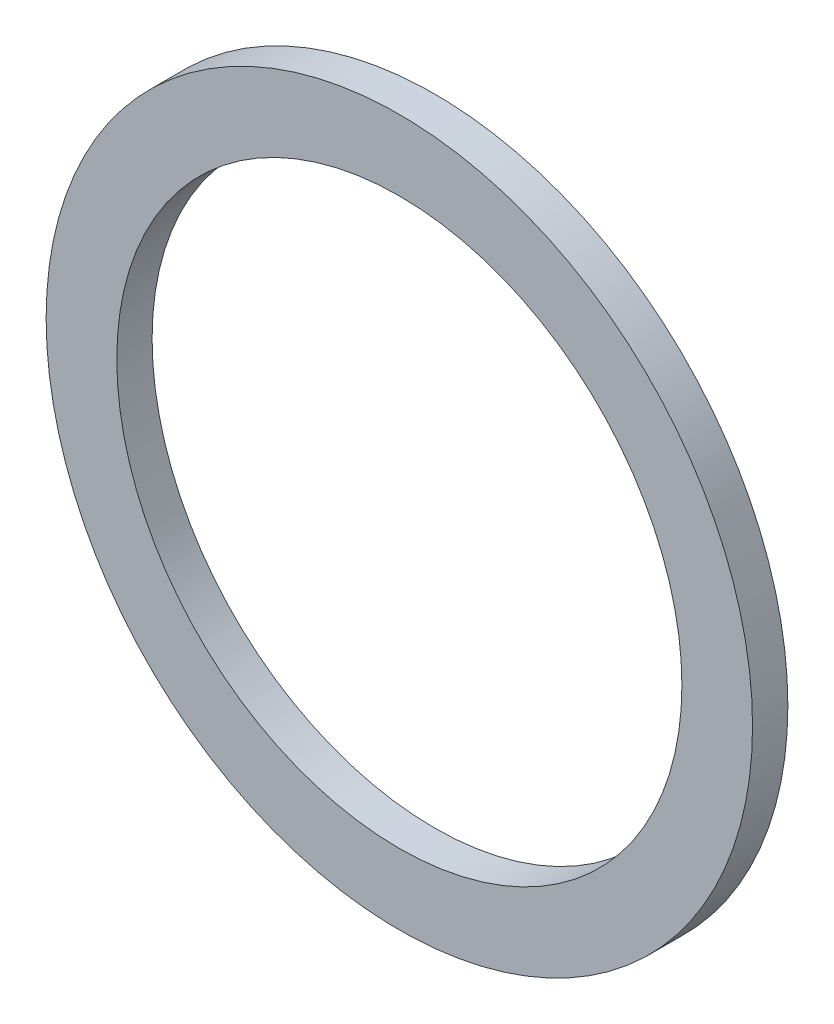
ISO-10303-21;
HEADER;
FILE_DESCRIPTION(('STEP AP214'),'2;1');
FILE_NAME('part.step','',(''),(''),'','','');
FILE_SCHEMA(('AUTOMOTIVE_DESIGN { 1 0 10303 214 1 1 1 1 }'));
ENDSEC;
DATA;
#1=APPLICATION_CONTEXT('core data for automotive mechanical design processes');
#2=APPLICATION_PROTOCOL_DEFINITION('international standard','automotive_design',2000,#1);
#3=PRODUCT_CONTEXT('',#1,'mechanical');
#4=PRODUCT('Part','Part','',(#3));
#5=PRODUCT_RELATED_PRODUCT_CATEGORY('part','',(#4));
#6=PRODUCT_DEFINITION_FORMATION('','',#4);
#7=PRODUCT_DEFINITION_CONTEXT('part definition',#1,'design');
#8=PRODUCT_DEFINITION('design','',#6,#7);
#9=PRODUCT_DEFINITION_SHAPE('','',#8);
#10=(LENGTH_UNIT() NAMED_UNIT(*) SI_UNIT(.MILLI.,.METRE.));
#11=(NAMED_UNIT(*) PLANE_ANGLE_UNIT() SI_UNIT($,.RADIAN.));
#12=(NAMED_UNIT(*) SI_UNIT($,.STERADIAN.) SOLID_ANGLE_UNIT());
#13=UNCERTAINTY_MEASURE_WITH_UNIT(LENGTH_MEASURE(1.E-05),#10,'distance_accuracy_value','');
#14=(GEOMETRIC_REPRESENTATION_CONTEXT(3) GLOBAL_UNCERTAINTY_ASSIGNED_CONTEXT((#13)) GLOBAL_UNIT_ASSIGNED_CONTEXT((#10,
#11,#12)) REPRESENTATION_CONTEXT('',''));
#15=CARTESIAN_POINT('',(0.,0.,0.));
#16=DIRECTION('',(0.,0.,1.));
#17=DIRECTION('',(1.,0.,0.));
#18=AXIS2_PLACEMENT_3D('',#15,#16,#17);
#19=CARTESIAN_POINT('',(-8.00000011920929,-2.00000002980232,2.));
#20=DIRECTION('',(0.,0.,1.));
#21=DIRECTION('',(1.,0.,0.));
#22=AXIS2_PLACEMENT_3D('',#19,#20,#21);
#23=PLANE('',#22);
#24=CARTESIAN_POINT('',(-8.00000011920929,-2.00000002980232,2.));
#25=DIRECTION('',(0.,0.,-1.));
#26=DIRECTION('',(-1.,0.,0.));
#27=AXIS2_PLACEMENT_3D('',#24,#25,#26);
#28=CIRCLE('',#27,0.800000014901161);
#29=CARTESIAN_POINT('',(-7.20000010430813,-2.00000002980232,2.));
#30=VERTEX_POINT('',#29);
#31=EDGE_CURVE('E50',#30,#30,#28,.T.);
#32=ORIENTED_EDGE('',*,*,#31,.F.);
#33=EDGE_LOOP('',(#32));
#34=FACE_BOUND('',#33,.T.);
#35=CARTESIAN_POINT('',(-8.00000011920929,-2.00000002980232,2.));
#36=DIRECTION('',(0.,0.,1.));
#37=DIRECTION('',(-1.,0.,0.));
#38=AXIS2_PLACEMENT_3D('',#35,#36,#37);
#39=CIRCLE('',#38,1.00000001490116);
#40=CARTESIAN_POINT('',(-7.00000010430813,-2.00000002980232,2.));
#41=VERTEX_POINT('',#40);
#42=EDGE_CURVE('E11',#41,#41,#39,.T.);
#43=ORIENTED_EDGE('',*,*,#42,.F.);
#44=EDGE_LOOP('',(#43));
#45=FACE_BOUND('',#44,.T.);
#46=ADVANCED_FACE('F17',(#34,#45),#23,.F.);
#47=CARTESIAN_POINT('',(-8.00000011920929,-2.00000002980232,2.1));
#48=DIRECTION('',(0.,0.,1.));
#49=DIRECTION('',(1.,0.,0.));
#50=AXIS2_PLACEMENT_3D('',#47,#48,#49);
#51=PLANE('',#50);
#52=CARTESIAN_POINT('',(-8.00000011920929,-2.00000002980232,2.1));
#53=DIRECTION('',(0.,0.,-1.));
#54=DIRECTION('',(-1.,0.,0.));
#55=AXIS2_PLACEMENT_3D('',#52,#53,#54);
#56=CIRCLE('',#55,0.800000014901161);
#57=CARTESIAN_POINT('',(-7.20000010430813,-2.00000002980232,2.1));
#58=VERTEX_POINT('',#57);
#59=EDGE_CURVE('E56',#58,#58,#56,.T.);
#60=ORIENTED_EDGE('',*,*,#59,.T.);
#61=EDGE_LOOP('',(#60));
#62=FACE_BOUND('',#61,.T.);
#63=CARTESIAN_POINT('',(-8.00000011920929,-2.00000002980232,2.1));
#64=DIRECTION('',(0.,0.,1.));
#65=DIRECTION('',(-1.,0.,0.));
#66=AXIS2_PLACEMENT_3D('',#63,#64,#65);
#67=CIRCLE('',#66,1.00000001490116);
#68=CARTESIAN_POINT('',(-7.00000010430813,-2.00000002980232,2.1));
#69=VERTEX_POINT('',#68);
#70=EDGE_CURVE('E66',#69,#69,#67,.T.);
#71=ORIENTED_EDGE('',*,*,#70,.T.);
#72=EDGE_LOOP('',(#71));
#73=FACE_BOUND('',#72,.T.);
#74=ADVANCED_FACE('F59',(#62,#73),#51,.T.);
#75=CARTESIAN_POINT('',(-8.00000011920929,-2.00000002980232,2.));
#76=DIRECTION('',(0.,0.,1.));
#77=DIRECTION('',(-1.,0.,0.));
#78=AXIS2_PLACEMENT_3D('',#75,#76,#77);
#79=CYLINDRICAL_SURFACE('',#78,1.00000001490116);
#80=ORIENTED_EDGE('',*,*,#70,.F.);
#81=DIRECTION('',(0.,0.,-1.));
#82=VECTOR('',#81,1.);
#83=CARTESIAN_POINT('',(-7.00000010430813,-2.00000002980232,2.));
#84=LINE('',#83,#82);
#85=EDGE_CURVE('E28',#69,#41,#84,.T.);
#86=ORIENTED_EDGE('',*,*,#85,.T.);
#87=ORIENTED_EDGE('',*,*,#42,.T.);
#88=ORIENTED_EDGE('',*,*,#85,.F.);
#89=EDGE_LOOP('',(#80,#86,#87,#88));
#90=FACE_BOUND('',#89,.T.);
#91=ADVANCED_FACE('F73',(#90),#79,.T.);
#92=CARTESIAN_POINT('',(-8.00000011920929,-2.00000002980232,2.));
#93=DIRECTION('',(0.,0.,1.));
#94=DIRECTION('',(-1.,0.,0.));
#95=AXIS2_PLACEMENT_3D('',#92,#93,#94);
#96=CYLINDRICAL_SURFACE('',#95,0.800000014901161);
#97=ORIENTED_EDGE('',*,*,#59,.F.);
#98=DIRECTION('',(0.,0.,-1.));
#99=VECTOR('',#98,1.);
#100=CARTESIAN_POINT('',(-7.20000010430813,-2.00000002980232,2.));
#101=LINE('',#100,#99);
#102=EDGE_CURVE('E21',#58,#30,#101,.T.);
#103=ORIENTED_EDGE('',*,*,#102,.T.);
#104=ORIENTED_EDGE('',*,*,#31,.T.);
#105=ORIENTED_EDGE('',*,*,#102,.F.);
#106=EDGE_LOOP('',(#97,#103,#104,#105));
#107=FACE_BOUND('',#106,.T.);
#108=ADVANCED_FACE('F19',(#107),#96,.F.);
#109=CLOSED_SHELL('',(#46,#74,#91,#108));
#110=MANIFOLD_SOLID_BREP('B1',#109);
#111=ADVANCED_BREP_SHAPE_REPRESENTATION('',(#18,#110),#14);
#112=SHAPE_DEFINITION_REPRESENTATION(#9,#111);
ENDSEC;
END-ISO-10303-21;
